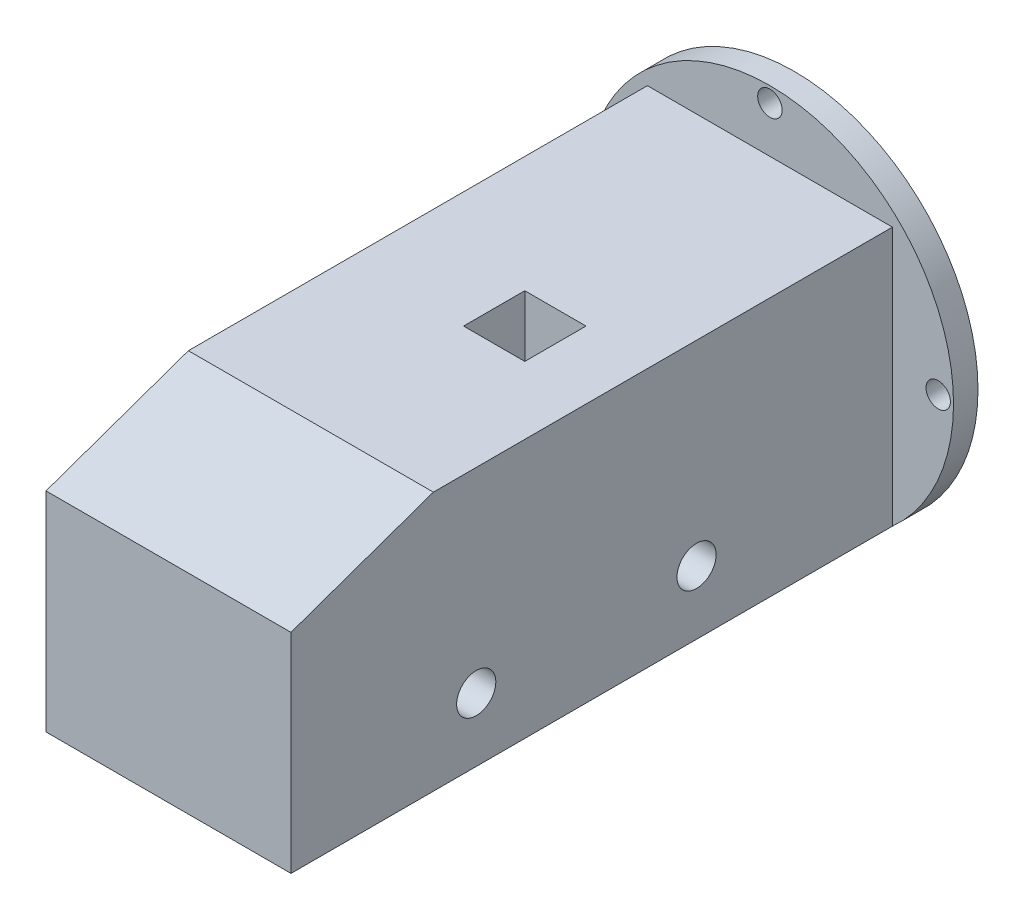
ISO-10303-21;
HEADER;
FILE_DESCRIPTION(('STEP AP214'),'2;1');
FILE_NAME('part.step','',(''),(''),'','','');
FILE_SCHEMA(('AUTOMOTIVE_DESIGN { 1 0 10303 214 1 1 1 1 }'));
ENDSEC;
DATA;
#1=APPLICATION_CONTEXT('core data for automotive mechanical design processes');
#2=APPLICATION_PROTOCOL_DEFINITION('international standard','automotive_design',2000,#1);
#3=PRODUCT_CONTEXT('',#1,'mechanical');
#4=PRODUCT('Part','Part','',(#3));
#5=PRODUCT_RELATED_PRODUCT_CATEGORY('part','',(#4));
#6=PRODUCT_DEFINITION_FORMATION('','',#4);
#7=PRODUCT_DEFINITION_CONTEXT('part definition',#1,'design');
#8=PRODUCT_DEFINITION('design','',#6,#7);
#9=PRODUCT_DEFINITION_SHAPE('','',#8);
#10=(LENGTH_UNIT() NAMED_UNIT(*) SI_UNIT(.MILLI.,.METRE.));
#11=(NAMED_UNIT(*) PLANE_ANGLE_UNIT() SI_UNIT($,.RADIAN.));
#12=(NAMED_UNIT(*) SI_UNIT($,.STERADIAN.) SOLID_ANGLE_UNIT());
#13=UNCERTAINTY_MEASURE_WITH_UNIT(LENGTH_MEASURE(1.E-05),#10,'distance_accuracy_value','');
#14=(GEOMETRIC_REPRESENTATION_CONTEXT(3) GLOBAL_UNCERTAINTY_ASSIGNED_CONTEXT((#13)) GLOBAL_UNIT_ASSIGNED_CONTEXT((#10,
#11,#12)) REPRESENTATION_CONTEXT('',''));
#15=CARTESIAN_POINT('',(0.,0.,0.));
#16=DIRECTION('',(0.,0.,1.));
#17=DIRECTION('',(1.,0.,0.));
#18=AXIS2_PLACEMENT_3D('',#15,#16,#17);
#19=CARTESIAN_POINT('',(8.98442745033423,-18.4610339679543,87.3736426774216));
#20=DIRECTION('',(0.,0.,1.));
#21=DIRECTION('',(1.,0.,0.));
#22=AXIS2_PLACEMENT_3D('',#19,#20,#21);
#23=PLANE('',#22);
#24=DIRECTION('',(0.,1.,0.));
#25=VECTOR('',#24,1.);
#26=CARTESIAN_POINT('',(-5.01557254966576,-18.4610339679543,87.3736426774216));
#27=LINE('',#26,#25);
#28=CARTESIAN_POINT('',(-5.01557254966576,-18.4610339679543,87.3736426774216));
#29=VERTEX_POINT('',#28);
#30=CARTESIAN_POINT('',(-5.01557254966576,-5.46103396795427,87.3736426774216));
#31=VERTEX_POINT('',#30);
#32=EDGE_CURVE('E238',#29,#31,#27,.T.);
#33=ORIENTED_EDGE('',*,*,#32,.F.);
#34=DIRECTION('',(-1.,0.,0.));
#35=VECTOR('',#34,1.);
#36=CARTESIAN_POINT('',(8.98442745033423,-18.4610339679543,87.3736426774216));
#37=LINE('',#36,#35);
#38=CARTESIAN_POINT('',(-8.01557254966577,-18.4610339679543,87.3736426774216));
#39=VERTEX_POINT('',#38);
#40=EDGE_CURVE('E336',#29,#39,#37,.T.);
#41=ORIENTED_EDGE('',*,*,#40,.T.);
#42=DIRECTION('',(0.,1.,0.));
#43=VECTOR('',#42,1.);
#44=CARTESIAN_POINT('',(-8.01557254966577,-18.4610339679543,87.3736426774216));
#45=LINE('',#44,#43);
#46=CARTESIAN_POINT('',(-8.01557254966577,-5.46103396795427,87.3736426774216));
#47=VERTEX_POINT('',#46);
#48=EDGE_CURVE('E325',#39,#47,#45,.T.);
#49=ORIENTED_EDGE('',*,*,#48,.T.);
#50=DIRECTION('',(-1.,0.,0.));
#51=VECTOR('',#50,1.);
#52=CARTESIAN_POINT('',(8.98442745033423,-5.46103396795427,87.3736426774216));
#53=LINE('',#52,#51);
#54=EDGE_CURVE('E334',#31,#47,#53,.T.);
#55=ORIENTED_EDGE('',*,*,#54,.F.);
#56=EDGE_LOOP('',(#33,#41,#49,#55));
#57=FACE_BOUND('',#56,.T.);
#58=ADVANCED_FACE('F48',(#57),#23,.F.);
#59=CARTESIAN_POINT('',(-3.01557254966577,-11.9610339679543,90.4236426774216));
#60=DIRECTION('',(-1.,0.,0.));
#61=DIRECTION('',(0.,0.,1.));
#62=AXIS2_PLACEMENT_3D('',#59,#60,#61);
#63=CYLINDRICAL_SURFACE('',#62,0.999999999999998);
#64=CARTESIAN_POINT('',(-8.01557254966577,-11.9610339679543,90.4236426774216));
#65=DIRECTION('',(-1.,0.,0.));
#66=DIRECTION('',(0.,0.,1.));
#67=AXIS2_PLACEMENT_3D('',#64,#65,#66);
#68=CIRCLE('',#67,0.999999999999998);
#69=CARTESIAN_POINT('',(-8.01557254966577,-11.9610339679543,91.4236426774216));
#70=VERTEX_POINT('',#69);
#71=EDGE_CURVE('E319',#70,#70,#68,.T.);
#72=ORIENTED_EDGE('',*,*,#71,.T.);
#73=EDGE_LOOP('',(#72));
#74=FACE_BOUND('',#73,.T.);
#75=CARTESIAN_POINT('',(-5.01557254966576,-11.9610339679543,90.4236426774216));
#76=DIRECTION('',(1.,0.,0.));
#77=DIRECTION('',(0.,1.,0.));
#78=AXIS2_PLACEMENT_3D('',#75,#76,#77);
#79=CIRCLE('',#78,0.999999999999998);
#80=CARTESIAN_POINT('',(-5.01557254966576,-10.9610339679543,90.4236426774216));
#81=VERTEX_POINT('',#80);
#82=EDGE_CURVE('E52',#81,#81,#79,.F.);
#83=ORIENTED_EDGE('',*,*,#82,.F.);
#84=EDGE_LOOP('',(#83));
#85=FACE_BOUND('',#84,.T.);
#86=ADVANCED_FACE('F454',(#74,#85),#63,.F.);
#87=CARTESIAN_POINT('',(0.,0.,60.0325967803664));
#88=DIRECTION('',(0.,0.,-1.));
#89=DIRECTION('',(-1.,0.,0.));
#90=AXIS2_PLACEMENT_3D('',#87,#88,#89);
#91=PLANE('',#90);
#92=DIRECTION('',(-1.,0.,0.));
#93=VECTOR('',#92,1.);
#94=CARTESIAN_POINT('',(8.98442745033423,-6.96103396795427,60.0325967803664));
#95=LINE('',#94,#93);
#96=CARTESIAN_POINT('',(8.98442745033423,-6.96103396795427,60.0325967803664));
#97=VERTEX_POINT('',#96);
#98=CARTESIAN_POINT('',(-1.01557254966576,-6.96103396795427,60.0325967803664));
#99=VERTEX_POINT('',#98);
#100=EDGE_CURVE('E257',#97,#99,#95,.T.);
#101=ORIENTED_EDGE('',*,*,#100,.F.);
#102=DIRECTION('',(0.,1.,0.));
#103=VECTOR('',#102,1.);
#104=CARTESIAN_POINT('',(8.98442745033423,-5.46103396795427,60.0325967803664));
#105=LINE('',#104,#103);
#106=CARTESIAN_POINT('',(8.98442745033423,-5.46103396795427,60.0325967803664));
#107=VERTEX_POINT('',#106);
#108=EDGE_CURVE('E284',#97,#107,#105,.T.);
#109=ORIENTED_EDGE('',*,*,#108,.T.);
#110=DIRECTION('',(-1.,0.,0.));
#111=VECTOR('',#110,1.);
#112=CARTESIAN_POINT('',(8.98442745033423,-5.46103396795427,60.0325967803664));
#113=LINE('',#112,#111);
#114=CARTESIAN_POINT('',(-5.01557254966576,-5.46103396795427,60.0325967803664));
#115=VERTEX_POINT('',#114);
#116=EDGE_CURVE('E210',#107,#115,#113,.T.);
#117=ORIENTED_EDGE('',*,*,#116,.T.);
#118=DIRECTION('',(0.,-1.,0.));
#119=VECTOR('',#118,1.);
#120=CARTESIAN_POINT('',(-5.01557254966576,-5.46103396795427,60.0325967803664));
#121=LINE('',#120,#119);
#122=CARTESIAN_POINT('',(-5.01557254966576,-18.4610339679543,60.0325967803664));
#123=VERTEX_POINT('',#122);
#124=EDGE_CURVE('E286',#115,#123,#121,.T.);
#125=ORIENTED_EDGE('',*,*,#124,.T.);
#126=DIRECTION('',(1.,0.,0.));
#127=VECTOR('',#126,1.);
#128=CARTESIAN_POINT('',(8.98442745033423,-18.4610339679543,60.0325967803664));
#129=LINE('',#128,#127);
#130=CARTESIAN_POINT('',(8.98442745033423,-18.4610339679543,60.0325967803664));
#131=VERTEX_POINT('',#130);
#132=EDGE_CURVE('E289',#123,#131,#129,.T.);
#133=ORIENTED_EDGE('',*,*,#132,.T.);
#134=CARTESIAN_POINT('',(8.98442745033423,-16.9394701423471,60.0325967803664));
#135=VERTEX_POINT('',#134);
#136=EDGE_CURVE('E281',#131,#135,#105,.T.);
#137=ORIENTED_EDGE('',*,*,#136,.T.);
#138=DIRECTION('',(1.,0.,0.));
#139=VECTOR('',#138,1.);
#140=CARTESIAN_POINT('',(8.98442745033423,-16.9394701423471,60.0325967803664));
#141=LINE('',#140,#139);
#142=CARTESIAN_POINT('',(-1.01557254966576,-16.9394701423471,60.0325967803664));
#143=VERTEX_POINT('',#142);
#144=EDGE_CURVE('E261',#143,#135,#141,.T.);
#145=ORIENTED_EDGE('',*,*,#144,.F.);
#146=DIRECTION('',(0.,-1.,0.));
#147=VECTOR('',#146,1.);
#148=CARTESIAN_POINT('',(-1.01557254966576,-6.96103396795427,60.0325967803664));
#149=LINE('',#148,#147);
#150=EDGE_CURVE('E73',#99,#143,#149,.T.);
#151=ORIENTED_EDGE('',*,*,#150,.F.);
#152=EDGE_LOOP('',(#101,#109,#117,#125,#133,#137,#145,#151));
#153=FACE_BOUND('',#152,.T.);
#154=ADVANCED_FACE('F460',(#153),#91,.F.);
#155=CARTESIAN_POINT('',(20.0155725496658,-22.3467414964479,154.));
#156=DIRECTION('',(0.,1.,0.));
#157=DIRECTION('',(0.,0.,1.));
#158=AXIS2_PLACEMENT_3D('',#155,#156,#157);
#159=PLANE('',#158);
#160=DIRECTION('',(-1.,0.,0.));
#161=VECTOR('',#160,1.);
#162=CARTESIAN_POINT('',(30.,-22.3467414964479,102.262078687684));
#163=LINE('',#162,#161);
#164=CARTESIAN_POINT('',(20.0155725496658,-22.3467414964479,102.262078687684));
#165=VERTEX_POINT('',#164);
#166=CARTESIAN_POINT('',(-20.0155725496658,-22.3467414964479,102.262078687684));
#167=VERTEX_POINT('',#166);
#168=EDGE_CURVE('E306',#165,#167,#163,.T.);
#169=ORIENTED_EDGE('',*,*,#168,.T.);
#170=DIRECTION('',(0.,0.,-1.));
#171=VECTOR('',#170,1.);
#172=CARTESIAN_POINT('',(-20.0155725496658,-22.3467414964479,154.));
#173=LINE('',#172,#171);
#174=CARTESIAN_POINT('',(-20.0155725496658,-22.3467414964479,4.));
#175=VERTEX_POINT('',#174);
#176=EDGE_CURVE('E390',#167,#175,#173,.T.);
#177=ORIENTED_EDGE('',*,*,#176,.T.);
#178=DIRECTION('',(1.,0.,0.));
#179=VECTOR('',#178,1.);
#180=CARTESIAN_POINT('',(20.0155725496658,-22.3467414964479,4.));
#181=LINE('',#180,#179);
#182=CARTESIAN_POINT('',(20.0155725496658,-22.3467414964479,4.));
#183=VERTEX_POINT('',#182);
#184=EDGE_CURVE('E378',#175,#183,#181,.T.);
#185=ORIENTED_EDGE('',*,*,#184,.T.);
#186=DIRECTION('',(0.,0.,-1.));
#187=VECTOR('',#186,1.);
#188=CARTESIAN_POINT('',(20.0155725496658,-22.3467414964479,154.));
#189=LINE('',#188,#187);
#190=EDGE_CURVE('E396',#165,#183,#189,.T.);
#191=ORIENTED_EDGE('',*,*,#190,.F.);
#192=EDGE_LOOP('',(#169,#177,#185,#191));
#193=FACE_BOUND('',#192,.T.);
#194=ADVANCED_FACE('F506',(#193),#159,.F.);
#195=CARTESIAN_POINT('',(20.0155725496658,19.9742180609268,154.));
#196=DIRECTION('',(-1.,0.,0.));
#197=DIRECTION('',(0.,0.,1.));
#198=AXIS2_PLACEMENT_3D('',#195,#196,#197);
#199=PLANE('',#198);
#200=CARTESIAN_POINT('',(20.0155725496658,-11.9610339679543,72.));
#201=DIRECTION('',(1.,0.,0.));
#202=DIRECTION('',(0.,0.,-1.));
#203=AXIS2_PLACEMENT_3D('',#200,#201,#202);
#204=CIRCLE('',#203,3.2);
#205=CARTESIAN_POINT('',(20.0155725496658,-11.9610339679543,68.8));
#206=VERTEX_POINT('',#205);
#207=EDGE_CURVE('E303',#206,#206,#204,.T.);
#208=ORIENTED_EDGE('',*,*,#207,.F.);
#209=EDGE_LOOP('',(#208));
#210=FACE_BOUND('',#209,.T.);
#211=CARTESIAN_POINT('',(20.0155725496658,-11.9610339679543,36.));
#212=DIRECTION('',(-1.,0.,0.));
#213=DIRECTION('',(0.,0.,1.));
#214=AXIS2_PLACEMENT_3D('',#211,#212,#213);
#215=CIRCLE('',#214,3.2);
#216=CARTESIAN_POINT('',(20.0155725496658,-11.9610339679543,39.2));
#217=VERTEX_POINT('',#216);
#218=EDGE_CURVE('E375',#217,#217,#215,.F.);
#219=ORIENTED_EDGE('',*,*,#218,.F.);
#220=EDGE_LOOP('',(#219));
#221=FACE_BOUND('',#220,.T.);
#222=DIRECTION('',(0.,1.,0.));
#223=VECTOR('',#222,1.);
#224=CARTESIAN_POINT('',(20.0155725496658,19.9742180609268,102.262078687684));
#225=LINE('',#224,#223);
#226=CARTESIAN_POINT('',(20.0155725496658,11.7672606789775,102.262078687684));
#227=VERTEX_POINT('',#226);
#228=EDGE_CURVE('E316',#165,#227,#225,.T.);
#229=ORIENTED_EDGE('',*,*,#228,.F.);
#230=ORIENTED_EDGE('',*,*,#190,.T.);
#231=DIRECTION('',(0.,1.,0.));
#232=VECTOR('',#231,1.);
#233=CARTESIAN_POINT('',(20.0155725496658,19.9742180609268,4.));
#234=LINE('',#233,#232);
#235=CARTESIAN_POINT('',(20.0155725496658,19.9742180609268,4.));
#236=VERTEX_POINT('',#235);
#237=EDGE_CURVE('E381',#183,#236,#234,.T.);
#238=ORIENTED_EDGE('',*,*,#237,.T.);
#239=DIRECTION('',(0.,0.,-1.));
#240=VECTOR('',#239,1.);
#241=CARTESIAN_POINT('',(20.0155725496658,19.9742180609268,154.));
#242=LINE('',#241,#240);
#243=CARTESIAN_POINT('',(20.0155725496658,19.9742180609268,79.));
#244=VERTEX_POINT('',#243);
#245=EDGE_CURVE('E394',#244,#236,#242,.T.);
#246=ORIENTED_EDGE('',*,*,#245,.F.);
#247=DIRECTION('',(0.,-0.332705190064486,0.943030888414666));
#248=VECTOR('',#247,1.);
#249=CARTESIAN_POINT('',(20.0155725496658,-3.55712726157436,145.698044237812));
#250=LINE('',#249,#248);
#251=EDGE_CURVE('E309',#244,#227,#250,.T.);
#252=ORIENTED_EDGE('',*,*,#251,.T.);
#253=EDGE_LOOP('',(#229,#230,#238,#246,#252));
#254=FACE_BOUND('',#253,.T.);
#255=ADVANCED_FACE('F498',(#210,#221,#254),#199,.F.);
#256=CARTESIAN_POINT('',(-20.0155725496658,19.9742180609268,154.));
#257=DIRECTION('',(1.,0.,0.));
#258=DIRECTION('',(0.,0.,-1.));
#259=AXIS2_PLACEMENT_3D('',#256,#257,#258);
#260=PLANE('',#259);
#261=CARTESIAN_POINT('',(-20.0155725496658,-11.9610339679543,36.));
#262=DIRECTION('',(-1.,0.,0.));
#263=DIRECTION('',(0.,0.,1.));
#264=AXIS2_PLACEMENT_3D('',#261,#262,#263);
#265=CIRCLE('',#264,3.2);
#266=CARTESIAN_POINT('',(-20.0155725496658,-11.9610339679543,39.2));
#267=VERTEX_POINT('',#266);
#268=EDGE_CURVE('E366',#267,#267,#265,.T.);
#269=ORIENTED_EDGE('',*,*,#268,.F.);
#270=EDGE_LOOP('',(#269));
#271=FACE_BOUND('',#270,.T.);
#272=DIRECTION('',(0.,-1.,0.));
#273=VECTOR('',#272,1.);
#274=CARTESIAN_POINT('',(-20.0155725496658,-5.46103396795427,60.0736426774216));
#275=LINE('',#274,#273);
#276=CARTESIAN_POINT('',(-20.0155725496658,-5.46103396795427,60.0736426774215));
#277=VERTEX_POINT('',#276);
#278=CARTESIAN_POINT('',(-20.0155725496658,-18.4610339679543,60.0736426774216));
#279=VERTEX_POINT('',#278);
#280=EDGE_CURVE('E355',#277,#279,#275,.T.);
#281=ORIENTED_EDGE('',*,*,#280,.F.);
#282=DIRECTION('',(0.,0.,-1.));
#283=VECTOR('',#282,1.);
#284=CARTESIAN_POINT('',(-20.0155725496658,-5.46103396795427,60.0736426774216));
#285=LINE('',#284,#283);
#286=CARTESIAN_POINT('',(-20.0155725496658,-5.46103396795427,93.4736426774216));
#287=VERTEX_POINT('',#286);
#288=EDGE_CURVE('E333',#287,#277,#285,.T.);
#289=ORIENTED_EDGE('',*,*,#288,.F.);
#290=DIRECTION('',(0.,1.,0.));
#291=VECTOR('',#290,1.);
#292=CARTESIAN_POINT('',(-20.0155725496658,-18.4610339679543,93.4736426774216));
#293=LINE('',#292,#291);
#294=CARTESIAN_POINT('',(-20.0155725496658,-18.4610339679543,93.4736426774216));
#295=VERTEX_POINT('',#294);
#296=EDGE_CURVE('E361',#295,#287,#293,.T.);
#297=ORIENTED_EDGE('',*,*,#296,.F.);
#298=DIRECTION('',(0.,0.,1.));
#299=VECTOR('',#298,1.);
#300=CARTESIAN_POINT('',(-20.0155725496658,-18.4610339679543,60.0736426774216));
#301=LINE('',#300,#299);
#302=EDGE_CURVE('E358',#279,#295,#301,.T.);
#303=ORIENTED_EDGE('',*,*,#302,.F.);
#304=EDGE_LOOP('',(#281,#289,#297,#303));
#305=FACE_BOUND('',#304,.T.);
#306=DIRECTION('',(0.,-1.,0.));
#307=VECTOR('',#306,1.);
#308=CARTESIAN_POINT('',(-20.0155725496658,19.9742180609268,102.262078687684));
#309=LINE('',#308,#307);
#310=CARTESIAN_POINT('',(-20.0155725496658,11.7672606789775,102.262078687684));
#311=VERTEX_POINT('',#310);
#312=EDGE_CURVE('E13',#311,#167,#309,.T.);
#313=ORIENTED_EDGE('',*,*,#312,.F.);
#314=DIRECTION('',(0.,0.332705190064486,-0.943030888414666));
#315=VECTOR('',#314,1.);
#316=CARTESIAN_POINT('',(-20.0155725496658,-3.55712726157436,145.698044237812));
#317=LINE('',#316,#315);
#318=CARTESIAN_POINT('',(-20.0155725496658,19.9742180609268,78.9999999999999));
#319=VERTEX_POINT('',#318);
#320=EDGE_CURVE('E57',#311,#319,#317,.T.);
#321=ORIENTED_EDGE('',*,*,#320,.T.);
#322=DIRECTION('',(0.,0.,-1.));
#323=VECTOR('',#322,1.);
#324=CARTESIAN_POINT('',(-20.0155725496658,19.9742180609268,154.));
#325=LINE('',#324,#323);
#326=CARTESIAN_POINT('',(-20.0155725496658,19.9742180609268,4.));
#327=VERTEX_POINT('',#326);
#328=EDGE_CURVE('E392',#319,#327,#325,.T.);
#329=ORIENTED_EDGE('',*,*,#328,.T.);
#330=DIRECTION('',(0.,-1.,0.));
#331=VECTOR('',#330,1.);
#332=CARTESIAN_POINT('',(-20.0155725496658,19.9742180609268,4.));
#333=LINE('',#332,#331);
#334=EDGE_CURVE('E387',#327,#175,#333,.T.);
#335=ORIENTED_EDGE('',*,*,#334,.T.);
#336=ORIENTED_EDGE('',*,*,#176,.F.);
#337=EDGE_LOOP('',(#313,#321,#329,#335,#336));
#338=FACE_BOUND('',#337,.T.);
#339=ADVANCED_FACE('F495',(#271,#305,#338),#260,.F.);
#340=CARTESIAN_POINT('',(-8.01557254966577,0.,0.));
#341=DIRECTION('',(-1.,0.,0.));
#342=DIRECTION('',(0.,0.,1.));
#343=AXIS2_PLACEMENT_3D('',#340,#341,#342);
#344=PLANE('',#343);
#345=CARTESIAN_POINT('',(-8.01557254966577,-11.9610339679543,63.103119728894));
#346=DIRECTION('',(-1.,0.,0.));
#347=DIRECTION('',(0.,0.,1.));
#348=AXIS2_PLACEMENT_3D('',#345,#346,#347);
#349=CIRCLE('',#348,0.999999999999998);
#350=CARTESIAN_POINT('',(-8.01557254966577,-11.9610339679543,64.103119728894));
#351=VERTEX_POINT('',#350);
#352=EDGE_CURVE('E318',#351,#351,#349,.T.);
#353=ORIENTED_EDGE('',*,*,#352,.F.);
#354=EDGE_LOOP('',(#353));
#355=FACE_BOUND('',#354,.T.);
#356=DIRECTION('',(0.,-1.,0.));
#357=VECTOR('',#356,1.);
#358=CARTESIAN_POINT('',(-8.01557254966577,-18.4610339679543,66.1325967803664));
#359=LINE('',#358,#357);
#360=CARTESIAN_POINT('',(-8.01557254966577,-5.46103396795427,66.1325967803664));
#361=VERTEX_POINT('',#360);
#362=CARTESIAN_POINT('',(-8.01557254966577,-18.4610339679543,66.1325967803664));
#363=VERTEX_POINT('',#362);
#364=EDGE_CURVE('E322',#361,#363,#359,.T.);
#365=ORIENTED_EDGE('',*,*,#364,.F.);
#366=DIRECTION('',(0.,0.,-1.));
#367=VECTOR('',#366,1.);
#368=CARTESIAN_POINT('',(-8.01557254966577,-5.46103396795427,60.0736426774216));
#369=LINE('',#368,#367);
#370=CARTESIAN_POINT('',(-8.01557254966577,-5.46103396795427,60.0736426774216));
#371=VERTEX_POINT('',#370);
#372=EDGE_CURVE('E343',#361,#371,#369,.T.);
#373=ORIENTED_EDGE('',*,*,#372,.T.);
#374=DIRECTION('',(0.,-1.,0.));
#375=VECTOR('',#374,1.);
#376=CARTESIAN_POINT('',(-8.01557254966577,-5.46103396795427,60.0736426774216));
#377=LINE('',#376,#375);
#378=CARTESIAN_POINT('',(-8.01557254966577,-18.4610339679543,60.0736426774216));
#379=VERTEX_POINT('',#378);
#380=EDGE_CURVE('E342',#371,#379,#377,.T.);
#381=ORIENTED_EDGE('',*,*,#380,.T.);
#382=DIRECTION('',(0.,0.,1.));
#383=VECTOR('',#382,1.);
#384=CARTESIAN_POINT('',(-8.01557254966577,-18.4610339679543,60.0736426774216));
#385=LINE('',#384,#383);
#386=EDGE_CURVE('E347',#379,#363,#385,.T.);
#387=ORIENTED_EDGE('',*,*,#386,.T.);
#388=EDGE_LOOP('',(#365,#373,#381,#387));
#389=FACE_BOUND('',#388,.T.);
#390=ADVANCED_FACE('F476',(#355,#389),#344,.T.);
#391=CARTESIAN_POINT('',(0.,0.,4.));
#392=DIRECTION('',(0.,0.,1.));
#393=DIRECTION('',(1.,0.,0.));
#394=AXIS2_PLACEMENT_3D('',#391,#392,#393);
#395=PLANE('',#394);
#396=ORIENTED_EDGE('',*,*,#184,.F.);
#397=CARTESIAN_POINT('',(0.,0.,4.));
#398=DIRECTION('',(0.,0.,1.));
#399=DIRECTION('',(1.,0.,0.));
#400=AXIS2_PLACEMENT_3D('',#397,#398,#399);
#401=CIRCLE('',#400,30.);
#402=EDGE_CURVE('E423',#175,#183,#401,.T.);
#403=ORIENTED_EDGE('',*,*,#402,.T.);
#404=EDGE_LOOP('',(#396,#403));
#405=FACE_BOUND('',#404,.T.);
#406=CARTESIAN_POINT('',(0.,-27.5,4.));
#407=DIRECTION('',(0.,0.,1.));
#408=DIRECTION('',(1.,0.,0.));
#409=AXIS2_PLACEMENT_3D('',#406,#407,#408);
#410=CIRCLE('',#409,1.99901261968799);
#411=CARTESIAN_POINT('',(1.9990126196879,-27.5,4.));
#412=VERTEX_POINT('',#411);
#413=EDGE_CURVE('E411',#412,#412,#410,.T.);
#414=ORIENTED_EDGE('',*,*,#413,.F.);
#415=EDGE_LOOP('',(#414));
#416=FACE_BOUND('',#415,.T.);
#417=ADVANCED_FACE('F529',(#405,#416),#395,.T.);
#418=ORIENTED_EDGE('',*,*,#334,.F.);
#419=DIRECTION('',(-1.,0.,0.));
#420=VECTOR('',#419,1.);
#421=CARTESIAN_POINT('',(-20.0155725496658,19.9742180609268,4.));
#422=LINE('',#421,#420);
#423=EDGE_CURVE('E384',#236,#327,#422,.T.);
#424=ORIENTED_EDGE('',*,*,#423,.F.);
#425=ORIENTED_EDGE('',*,*,#237,.F.);
#426=EDGE_CURVE('E426',#183,#175,#401,.T.);
#427=ORIENTED_EDGE('',*,*,#426,.T.);
#428=EDGE_LOOP('',(#418,#424,#425,#427));
#429=FACE_BOUND('',#428,.T.);
#430=CARTESIAN_POINT('',(-27.5,1.92031473636372E-13,4.));
#431=DIRECTION('',(0.,0.,1.));
#432=DIRECTION('',(1.,0.,0.));
#433=AXIS2_PLACEMENT_3D('',#430,#431,#432);
#434=CIRCLE('',#433,1.99901261968799);
#435=CARTESIAN_POINT('',(-25.500987380312,1.92031473636372E-13,4.));
#436=VERTEX_POINT('',#435);
#437=EDGE_CURVE('E405',#436,#436,#434,.T.);
#438=ORIENTED_EDGE('',*,*,#437,.F.);
#439=EDGE_LOOP('',(#438));
#440=FACE_BOUND('',#439,.T.);
#441=CARTESIAN_POINT('',(27.5,0.,4.));
#442=DIRECTION('',(0.,0.,1.));
#443=DIRECTION('',(1.,0.,0.));
#444=AXIS2_PLACEMENT_3D('',#441,#442,#443);
#445=CIRCLE('',#444,1.99901261968799);
#446=CARTESIAN_POINT('',(29.499012619688,0.,4.));
#447=VERTEX_POINT('',#446);
#448=EDGE_CURVE('E417',#447,#447,#445,.T.);
#449=ORIENTED_EDGE('',*,*,#448,.F.);
#450=EDGE_LOOP('',(#449));
#451=FACE_BOUND('',#450,.T.);
#452=CARTESIAN_POINT('',(2.88047210454558E-13,27.5,4.));
#453=DIRECTION('',(0.,0.,1.));
#454=DIRECTION('',(1.,0.,0.));
#455=AXIS2_PLACEMENT_3D('',#452,#453,#454);
#456=CIRCLE('',#455,1.99901261968799);
#457=CARTESIAN_POINT('',(1.99901261968828,27.5,4.));
#458=VERTEX_POINT('',#457);
#459=EDGE_CURVE('E399',#458,#458,#456,.T.);
#460=ORIENTED_EDGE('',*,*,#459,.F.);
#461=EDGE_LOOP('',(#460));
#462=FACE_BOUND('',#461,.T.);
#463=ADVANCED_FACE('F526',(#429,#440,#451,#462),#395,.T.);
#464=CARTESIAN_POINT('',(0.,0.,0.));
#465=DIRECTION('',(0.,0.,1.));
#466=DIRECTION('',(1.,0.,0.));
#467=AXIS2_PLACEMENT_3D('',#464,#465,#466);
#468=PLANE('',#467);
#469=CARTESIAN_POINT('',(0.,0.,0.));
#470=DIRECTION('',(0.,0.,1.));
#471=DIRECTION('',(1.,0.,0.));
#472=AXIS2_PLACEMENT_3D('',#469,#470,#471);
#473=CIRCLE('',#472,30.);
#474=CARTESIAN_POINT('',(30.,0.,0.));
#475=VERTEX_POINT('',#474);
#476=EDGE_CURVE('E420',#475,#475,#473,.T.);
#477=ORIENTED_EDGE('',*,*,#476,.F.);
#478=EDGE_LOOP('',(#477));
#479=FACE_BOUND('',#478,.T.);
#480=CARTESIAN_POINT('',(27.5,0.,0.));
#481=DIRECTION('',(0.,0.,1.));
#482=DIRECTION('',(1.,0.,0.));
#483=AXIS2_PLACEMENT_3D('',#480,#481,#482);
#484=CIRCLE('',#483,1.99901261968799);
#485=CARTESIAN_POINT('',(29.499012619688,0.,0.));
#486=VERTEX_POINT('',#485);
#487=EDGE_CURVE('E414',#486,#486,#484,.T.);
#488=ORIENTED_EDGE('',*,*,#487,.T.);
#489=EDGE_LOOP('',(#488));
#490=FACE_BOUND('',#489,.T.);
#491=CARTESIAN_POINT('',(0.,-27.5,0.));
#492=DIRECTION('',(0.,0.,1.));
#493=DIRECTION('',(1.,0.,0.));
#494=AXIS2_PLACEMENT_3D('',#491,#492,#493);
#495=CIRCLE('',#494,1.99901261968799);
#496=CARTESIAN_POINT('',(1.9990126196879,-27.5,0.));
#497=VERTEX_POINT('',#496);
#498=EDGE_CURVE('E408',#497,#497,#495,.T.);
#499=ORIENTED_EDGE('',*,*,#498,.T.);
#500=EDGE_LOOP('',(#499));
#501=FACE_BOUND('',#500,.T.);
#502=CARTESIAN_POINT('',(-27.5,1.92031473636372E-13,0.));
#503=DIRECTION('',(0.,0.,1.));
#504=DIRECTION('',(1.,0.,0.));
#505=AXIS2_PLACEMENT_3D('',#502,#503,#504);
#506=CIRCLE('',#505,1.99901261968799);
#507=CARTESIAN_POINT('',(-25.500987380312,1.92031473636372E-13,0.));
#508=VERTEX_POINT('',#507);
#509=EDGE_CURVE('E402',#508,#508,#506,.T.);
#510=ORIENTED_EDGE('',*,*,#509,.T.);
#511=EDGE_LOOP('',(#510));
#512=FACE_BOUND('',#511,.T.);
#513=CARTESIAN_POINT('',(2.88047210454558E-13,27.5,0.));
#514=DIRECTION('',(0.,0.,1.));
#515=DIRECTION('',(1.,0.,0.));
#516=AXIS2_PLACEMENT_3D('',#513,#514,#515);
#517=CIRCLE('',#516,1.99901261968799);
#518=CARTESIAN_POINT('',(1.99901261968828,27.5,0.));
#519=VERTEX_POINT('',#518);
#520=EDGE_CURVE('E398',#519,#519,#517,.T.);
#521=ORIENTED_EDGE('',*,*,#520,.T.);
#522=EDGE_LOOP('',(#521));
#523=FACE_BOUND('',#522,.T.);
#524=ADVANCED_FACE('F528',(#479,#490,#501,#512,#523),#468,.F.);
#525=CARTESIAN_POINT('',(0.,0.,4.));
#526=DIRECTION('',(0.,0.,-1.));
#527=DIRECTION('',(-1.,0.,0.));
#528=AXIS2_PLACEMENT_3D('',#525,#526,#527);
#529=CYLINDRICAL_SURFACE('',#528,30.);
#530=ORIENTED_EDGE('',*,*,#402,.F.);
#531=ORIENTED_EDGE('',*,*,#426,.F.);
#532=EDGE_LOOP('',(#530,#531));
#533=FACE_BOUND('',#532,.T.);
#534=ORIENTED_EDGE('',*,*,#476,.T.);
#535=EDGE_LOOP('',(#534));
#536=FACE_BOUND('',#535,.T.);
#537=ADVANCED_FACE('F50',(#533,#536),#529,.T.);
#538=CARTESIAN_POINT('',(27.5,0.,4.));
#539=DIRECTION('',(0.,0.,-1.));
#540=DIRECTION('',(-1.,0.,0.));
#541=AXIS2_PLACEMENT_3D('',#538,#539,#540);
#542=CYLINDRICAL_SURFACE('',#541,1.99901261968799);
#543=ORIENTED_EDGE('',*,*,#448,.T.);
#544=EDGE_LOOP('',(#543));
#545=FACE_BOUND('',#544,.T.);
#546=ORIENTED_EDGE('',*,*,#487,.F.);
#547=EDGE_LOOP('',(#546));
#548=FACE_BOUND('',#547,.T.);
#549=ADVANCED_FACE('F521',(#545,#548),#542,.F.);
#550=CARTESIAN_POINT('',(0.,-27.5,4.));
#551=DIRECTION('',(0.,0.,-1.));
#552=DIRECTION('',(-1.,0.,0.));
#553=AXIS2_PLACEMENT_3D('',#550,#551,#552);
#554=CYLINDRICAL_SURFACE('',#553,1.99901261968799);
#555=ORIENTED_EDGE('',*,*,#413,.T.);
#556=EDGE_LOOP('',(#555));
#557=FACE_BOUND('',#556,.T.);
#558=ORIENTED_EDGE('',*,*,#498,.F.);
#559=EDGE_LOOP('',(#558));
#560=FACE_BOUND('',#559,.T.);
#561=ADVANCED_FACE('F517',(#557,#560),#554,.F.);
#562=CARTESIAN_POINT('',(-27.5,1.92031473636372E-13,4.));
#563=DIRECTION('',(0.,0.,-1.));
#564=DIRECTION('',(-1.,0.,0.));
#565=AXIS2_PLACEMENT_3D('',#562,#563,#564);
#566=CYLINDRICAL_SURFACE('',#565,1.99901261968799);
#567=ORIENTED_EDGE('',*,*,#437,.T.);
#568=EDGE_LOOP('',(#567));
#569=FACE_BOUND('',#568,.T.);
#570=ORIENTED_EDGE('',*,*,#509,.F.);
#571=EDGE_LOOP('',(#570));
#572=FACE_BOUND('',#571,.T.);
#573=ADVANCED_FACE('F513',(#569,#572),#566,.F.);
#574=CARTESIAN_POINT('',(2.88047210454558E-13,27.5,4.));
#575=DIRECTION('',(0.,0.,-1.));
#576=DIRECTION('',(-1.,0.,0.));
#577=AXIS2_PLACEMENT_3D('',#574,#575,#576);
#578=CYLINDRICAL_SURFACE('',#577,1.99901261968799);
#579=ORIENTED_EDGE('',*,*,#459,.T.);
#580=EDGE_LOOP('',(#579));
#581=FACE_BOUND('',#580,.T.);
#582=ORIENTED_EDGE('',*,*,#520,.F.);
#583=EDGE_LOOP('',(#582));
#584=FACE_BOUND('',#583,.T.);
#585=ADVANCED_FACE('F502',(#581,#584),#578,.F.);
#586=CARTESIAN_POINT('',(-20.0155725496658,19.9742180609268,154.));
#587=DIRECTION('',(0.,-1.,0.));
#588=DIRECTION('',(0.,0.,-1.));
#589=AXIS2_PLACEMENT_3D('',#586,#587,#588);
#590=PLANE('',#589);
#591=DIRECTION('',(1.,0.,0.));
#592=VECTOR('',#591,1.);
#593=CARTESIAN_POINT('',(-20.0155725496658,19.9742180609268,43.0325967803664));
#594=LINE('',#593,#592);
#595=CARTESIAN_POINT('',(-1.01557254966577,19.9742180609268,43.0325967803664));
#596=VERTEX_POINT('',#595);
#597=CARTESIAN_POINT('',(8.98442745033423,19.9742180609268,43.0325967803664));
#598=VERTEX_POINT('',#597);
#599=EDGE_CURVE('E251',#596,#598,#594,.T.);
#600=ORIENTED_EDGE('',*,*,#599,.T.);
#601=DIRECTION('',(0.,0.,1.));
#602=VECTOR('',#601,1.);
#603=CARTESIAN_POINT('',(8.98442745033423,19.9742180609268,154.));
#604=LINE('',#603,#602);
#605=CARTESIAN_POINT('',(8.98442745033423,19.9742180609268,53.0325967803664));
#606=VERTEX_POINT('',#605);
#607=EDGE_CURVE('E254',#598,#606,#604,.T.);
#608=ORIENTED_EDGE('',*,*,#607,.T.);
#609=DIRECTION('',(-1.,0.,0.));
#610=VECTOR('',#609,1.);
#611=CARTESIAN_POINT('',(-20.0155725496658,19.9742180609268,53.0325967803664));
#612=LINE('',#611,#610);
#613=CARTESIAN_POINT('',(-1.01557254966576,19.9742180609268,53.0325967803664));
#614=VERTEX_POINT('',#613);
#615=EDGE_CURVE('E244',#606,#614,#612,.T.);
#616=ORIENTED_EDGE('',*,*,#615,.T.);
#617=DIRECTION('',(0.,0.,-1.));
#618=VECTOR('',#617,1.);
#619=CARTESIAN_POINT('',(-1.01557254966576,19.9742180609268,154.));
#620=LINE('',#619,#618);
#621=EDGE_CURVE('E248',#614,#596,#620,.T.);
#622=ORIENTED_EDGE('',*,*,#621,.T.);
#623=EDGE_LOOP('',(#600,#608,#616,#622));
#624=FACE_BOUND('',#623,.T.);
#625=ORIENTED_EDGE('',*,*,#328,.F.);
#626=DIRECTION('',(-1.,0.,0.));
#627=VECTOR('',#626,1.);
#628=CARTESIAN_POINT('',(30.,19.9742180609268,79.));
#629=LINE('',#628,#627);
#630=EDGE_CURVE('E302',#244,#319,#629,.T.);
#631=ORIENTED_EDGE('',*,*,#630,.F.);
#632=ORIENTED_EDGE('',*,*,#245,.T.);
#633=ORIENTED_EDGE('',*,*,#423,.T.);
#634=EDGE_LOOP('',(#625,#631,#632,#633));
#635=FACE_BOUND('',#634,.T.);
#636=ADVANCED_FACE('F493',(#624,#635),#590,.F.);
#637=CARTESIAN_POINT('',(30.001,-11.9610339679543,36.));
#638=DIRECTION('',(-1.,0.,0.));
#639=DIRECTION('',(0.,0.,1.));
#640=AXIS2_PLACEMENT_3D('',#637,#638,#639);
#641=CYLINDRICAL_SURFACE('',#640,3.2);
#642=ORIENTED_EDGE('',*,*,#268,.T.);
#643=EDGE_LOOP('',(#642));
#644=FACE_BOUND('',#643,.T.);
#645=ORIENTED_EDGE('',*,*,#218,.T.);
#646=EDGE_LOOP('',(#645));
#647=FACE_BOUND('',#646,.T.);
#648=ADVANCED_FACE('F490',(#644,#647),#641,.F.);
#649=CARTESIAN_POINT('',(-8.01557254966577,-5.46103396795427,60.0736426774216));
#650=DIRECTION('',(0.,1.,0.));
#651=DIRECTION('',(0.,0.,1.));
#652=AXIS2_PLACEMENT_3D('',#649,#650,#651);
#653=PLANE('',#652);
#654=ORIENTED_EDGE('',*,*,#116,.F.);
#655=DIRECTION('',(0.,0.,-1.));
#656=VECTOR('',#655,1.);
#657=CARTESIAN_POINT('',(8.98442745033423,-5.46103396795427,87.3736426774216));
#658=LINE('',#657,#656);
#659=CARTESIAN_POINT('',(8.98442745033423,-5.46103396795427,93.4325967803664));
#660=VERTEX_POINT('',#659);
#661=EDGE_CURVE('E203',#660,#107,#658,.T.);
#662=ORIENTED_EDGE('',*,*,#661,.F.);
#663=DIRECTION('',(-1.,0.,0.));
#664=VECTOR('',#663,1.);
#665=CARTESIAN_POINT('',(8.98442745033423,-5.46103396795427,93.4325967803664));
#666=LINE('',#665,#664);
#667=CARTESIAN_POINT('',(-5.01557254966576,-5.46103396795427,93.4325967803664));
#668=VERTEX_POINT('',#667);
#669=EDGE_CURVE('E207',#660,#668,#666,.T.);
#670=ORIENTED_EDGE('',*,*,#669,.T.);
#671=DIRECTION('',(0.,0.,-1.));
#672=VECTOR('',#671,1.);
#673=CARTESIAN_POINT('',(-5.01557254966576,-5.46103396795427,93.4325967803664));
#674=LINE('',#673,#672);
#675=EDGE_CURVE('E236',#668,#31,#674,.T.);
#676=ORIENTED_EDGE('',*,*,#675,.T.);
#677=ORIENTED_EDGE('',*,*,#54,.T.);
#678=CARTESIAN_POINT('',(-8.01557254966577,-5.46103396795427,93.4736426774216));
#679=VERTEX_POINT('',#678);
#680=EDGE_CURVE('E339',#679,#47,#369,.T.);
#681=ORIENTED_EDGE('',*,*,#680,.F.);
#682=DIRECTION('',(-1.,0.,0.));
#683=VECTOR('',#682,1.);
#684=CARTESIAN_POINT('',(-8.01557254966577,-5.46103396795427,93.4736426774216));
#685=LINE('',#684,#683);
#686=EDGE_CURVE('E364',#679,#287,#685,.T.);
#687=ORIENTED_EDGE('',*,*,#686,.T.);
#688=ORIENTED_EDGE('',*,*,#288,.T.);
#689=DIRECTION('',(-1.,0.,0.));
#690=VECTOR('',#689,1.);
#691=CARTESIAN_POINT('',(-8.01557254966577,-5.46103396795427,60.0736426774216));
#692=LINE('',#691,#690);
#693=EDGE_CURVE('E353',#371,#277,#692,.T.);
#694=ORIENTED_EDGE('',*,*,#693,.F.);
#695=ORIENTED_EDGE('',*,*,#372,.F.);
#696=DIRECTION('',(-1.,0.,0.));
#697=VECTOR('',#696,1.);
#698=CARTESIAN_POINT('',(8.98442745033423,-5.46103396795427,66.1325967803664));
#699=LINE('',#698,#697);
#700=CARTESIAN_POINT('',(-5.01557254966576,-5.46103396795427,66.1325967803664));
#701=VERTEX_POINT('',#700);
#702=EDGE_CURVE('E331',#701,#361,#699,.T.);
#703=ORIENTED_EDGE('',*,*,#702,.F.);
#704=DIRECTION('',(0.,0.,1.));
#705=VECTOR('',#704,1.);
#706=CARTESIAN_POINT('',(-5.01557254966576,-5.46103396795427,60.0325967803664));
#707=LINE('',#706,#705);
#708=EDGE_CURVE('E292',#115,#701,#707,.T.);
#709=ORIENTED_EDGE('',*,*,#708,.F.);
#710=EDGE_LOOP('',(#654,#662,#670,#676,#677,#681,#687,#688,#694,#695,#703,#709));
#711=FACE_BOUND('',#710,.T.);
#712=ADVANCED_FACE('F205',(#711),#653,.F.);
#713=CARTESIAN_POINT('',(-8.01557254966577,-18.4610339679543,93.4736426774216));
#714=DIRECTION('',(0.,0.,1.));
#715=DIRECTION('',(1.,0.,0.));
#716=AXIS2_PLACEMENT_3D('',#713,#714,#715);
#717=PLANE('',#716);
#718=ORIENTED_EDGE('',*,*,#296,.T.);
#719=ORIENTED_EDGE('',*,*,#686,.F.);
#720=DIRECTION('',(0.,1.,0.));
#721=VECTOR('',#720,1.);
#722=CARTESIAN_POINT('',(-8.01557254966577,-18.4610339679543,93.4736426774216));
#723=LINE('',#722,#721);
#724=CARTESIAN_POINT('',(-8.01557254966577,-18.4610339679543,93.4736426774216));
#725=VERTEX_POINT('',#724);
#726=EDGE_CURVE('E350',#725,#679,#723,.T.);
#727=ORIENTED_EDGE('',*,*,#726,.F.);
#728=DIRECTION('',(-1.,0.,0.));
#729=VECTOR('',#728,1.);
#730=CARTESIAN_POINT('',(-8.01557254966577,-18.4610339679543,93.4736426774216));
#731=LINE('',#730,#729);
#732=EDGE_CURVE('E367',#725,#295,#731,.T.);
#733=ORIENTED_EDGE('',*,*,#732,.T.);
#734=EDGE_LOOP('',(#718,#719,#727,#733));
#735=FACE_BOUND('',#734,.T.);
#736=ADVANCED_FACE('F477',(#735),#717,.F.);
#737=CARTESIAN_POINT('',(-8.01557254966577,-18.4610339679543,60.0736426774216));
#738=DIRECTION('',(0.,-1.,0.));
#739=DIRECTION('',(0.,0.,-1.));
#740=AXIS2_PLACEMENT_3D('',#737,#738,#739);
#741=PLANE('',#740);
#742=DIRECTION('',(0.,0.,1.));
#743=VECTOR('',#742,1.);
#744=CARTESIAN_POINT('',(-5.01557254966576,-18.4610339679543,60.0325967803664));
#745=LINE('',#744,#743);
#746=CARTESIAN_POINT('',(-5.01557254966576,-18.4610339679543,66.1325967803664));
#747=VERTEX_POINT('',#746);
#748=EDGE_CURVE('E295',#123,#747,#745,.T.);
#749=ORIENTED_EDGE('',*,*,#748,.T.);
#750=DIRECTION('',(-1.,0.,0.));
#751=VECTOR('',#750,1.);
#752=CARTESIAN_POINT('',(8.98442745033423,-18.4610339679543,66.1325967803664));
#753=LINE('',#752,#751);
#754=EDGE_CURVE('E215',#747,#363,#753,.T.);
#755=ORIENTED_EDGE('',*,*,#754,.T.);
#756=ORIENTED_EDGE('',*,*,#386,.F.);
#757=DIRECTION('',(-1.,0.,0.));
#758=VECTOR('',#757,1.);
#759=CARTESIAN_POINT('',(-8.01557254966577,-18.4610339679543,60.0736426774216));
#760=LINE('',#759,#758);
#761=EDGE_CURVE('E369',#379,#279,#760,.T.);
#762=ORIENTED_EDGE('',*,*,#761,.T.);
#763=ORIENTED_EDGE('',*,*,#302,.T.);
#764=ORIENTED_EDGE('',*,*,#732,.F.);
#765=EDGE_CURVE('E346',#39,#725,#385,.T.);
#766=ORIENTED_EDGE('',*,*,#765,.F.);
#767=ORIENTED_EDGE('',*,*,#40,.F.);
#768=DIRECTION('',(0.,0.,-1.));
#769=VECTOR('',#768,1.);
#770=CARTESIAN_POINT('',(-5.01557254966576,-18.4610339679543,93.4325967803664));
#771=LINE('',#770,#769);
#772=CARTESIAN_POINT('',(-5.01557254966576,-18.4610339679543,93.4325967803664));
#773=VERTEX_POINT('',#772);
#774=EDGE_CURVE('E234',#773,#29,#771,.T.);
#775=ORIENTED_EDGE('',*,*,#774,.F.);
#776=DIRECTION('',(1.,0.,0.));
#777=VECTOR('',#776,1.);
#778=CARTESIAN_POINT('',(8.98442745033423,-18.4610339679543,93.4325967803664));
#779=LINE('',#778,#777);
#780=CARTESIAN_POINT('',(8.98442745033423,-18.4610339679543,93.4325967803664));
#781=VERTEX_POINT('',#780);
#782=EDGE_CURVE('E232',#773,#781,#779,.T.);
#783=ORIENTED_EDGE('',*,*,#782,.T.);
#784=DIRECTION('',(0.,0.,1.));
#785=VECTOR('',#784,1.);
#786=CARTESIAN_POINT('',(8.98442745033423,-18.4610339679543,87.3736426774216));
#787=LINE('',#786,#785);
#788=EDGE_CURVE('E216',#131,#781,#787,.T.);
#789=ORIENTED_EDGE('',*,*,#788,.F.);
#790=ORIENTED_EDGE('',*,*,#132,.F.);
#791=EDGE_LOOP('',(#749,#755,#756,#762,#763,#764,#766,#767,#775,#783,#789,#790));
#792=FACE_BOUND('',#791,.T.);
#793=ADVANCED_FACE('F480',(#792),#741,.F.);
#794=CARTESIAN_POINT('',(-8.01557254966577,-5.46103396795427,60.0736426774216));
#795=DIRECTION('',(0.,0.,-1.));
#796=DIRECTION('',(-1.,0.,0.));
#797=AXIS2_PLACEMENT_3D('',#794,#795,#796);
#798=PLANE('',#797);
#799=ORIENTED_EDGE('',*,*,#280,.T.);
#800=ORIENTED_EDGE('',*,*,#761,.F.);
#801=ORIENTED_EDGE('',*,*,#380,.F.);
#802=ORIENTED_EDGE('',*,*,#693,.T.);
#803=EDGE_LOOP('',(#799,#800,#801,#802));
#804=FACE_BOUND('',#803,.T.);
#805=ADVANCED_FACE('F474',(#804),#798,.F.);
#806=ORIENTED_EDGE('',*,*,#71,.F.);
#807=EDGE_LOOP('',(#806));
#808=FACE_BOUND('',#807,.T.);
#809=ORIENTED_EDGE('',*,*,#48,.F.);
#810=ORIENTED_EDGE('',*,*,#765,.T.);
#811=ORIENTED_EDGE('',*,*,#726,.T.);
#812=ORIENTED_EDGE('',*,*,#680,.T.);
#813=EDGE_LOOP('',(#809,#810,#811,#812));
#814=FACE_BOUND('',#813,.T.);
#815=ADVANCED_FACE('F470',(#808,#814),#344,.T.);
#816=CARTESIAN_POINT('',(8.98442745033423,-18.4610339679543,66.1325967803664));
#817=DIRECTION('',(0.,0.,-1.));
#818=DIRECTION('',(-1.,0.,0.));
#819=AXIS2_PLACEMENT_3D('',#816,#817,#818);
#820=PLANE('',#819);
#821=ORIENTED_EDGE('',*,*,#754,.F.);
#822=DIRECTION('',(0.,-1.,0.));
#823=VECTOR('',#822,1.);
#824=CARTESIAN_POINT('',(-5.01557254966576,-5.46103396795427,66.1325967803664));
#825=LINE('',#824,#823);
#826=EDGE_CURVE('E275',#701,#747,#825,.T.);
#827=ORIENTED_EDGE('',*,*,#826,.F.);
#828=ORIENTED_EDGE('',*,*,#702,.T.);
#829=ORIENTED_EDGE('',*,*,#364,.T.);
#830=EDGE_LOOP('',(#821,#827,#828,#829));
#831=FACE_BOUND('',#830,.T.);
#832=ADVANCED_FACE('F467',(#831),#820,.F.);
#833=CARTESIAN_POINT('',(8.98442745033423,0.,0.));
#834=DIRECTION('',(-1.,0.,0.));
#835=DIRECTION('',(0.,0.,1.));
#836=AXIS2_PLACEMENT_3D('',#833,#834,#835);
#837=PLANE('',#836);
#838=ORIENTED_EDGE('',*,*,#788,.T.);
#839=DIRECTION('',(0.,1.,0.));
#840=VECTOR('',#839,1.);
#841=CARTESIAN_POINT('',(8.98442745033423,-5.46103396795427,93.4325967803664));
#842=LINE('',#841,#840);
#843=EDGE_CURVE('E223',#781,#660,#842,.T.);
#844=ORIENTED_EDGE('',*,*,#843,.T.);
#845=ORIENTED_EDGE('',*,*,#661,.T.);
#846=ORIENTED_EDGE('',*,*,#108,.F.);
#847=DIRECTION('',(0.,0.,1.));
#848=VECTOR('',#847,1.);
#849=CARTESIAN_POINT('',(8.98442745033423,-6.96103396795427,43.0325967803664));
#850=LINE('',#849,#848);
#851=CARTESIAN_POINT('',(8.98442745033423,-6.96103396795427,53.0325967803664));
#852=VERTEX_POINT('',#851);
#853=EDGE_CURVE('E267',#852,#97,#850,.T.);
#854=ORIENTED_EDGE('',*,*,#853,.F.);
#855=DIRECTION('',(0.,-1.,0.));
#856=VECTOR('',#855,1.);
#857=CARTESIAN_POINT('',(8.98442745033423,38.0389660320457,53.0325967803664));
#858=LINE('',#857,#856);
#859=EDGE_CURVE('E242',#606,#852,#858,.T.);
#860=ORIENTED_EDGE('',*,*,#859,.F.);
#861=ORIENTED_EDGE('',*,*,#607,.F.);
#862=DIRECTION('',(0.,1.,0.));
#863=VECTOR('',#862,1.);
#864=CARTESIAN_POINT('',(8.98442745033423,-6.96103396795427,43.0325967803664));
#865=LINE('',#864,#863);
#866=CARTESIAN_POINT('',(8.98442745033423,-16.9394701423471,43.0325967803664));
#867=VERTEX_POINT('',#866);
#868=EDGE_CURVE('E258',#867,#598,#865,.T.);
#869=ORIENTED_EDGE('',*,*,#868,.F.);
#870=DIRECTION('',(0.,0.,1.));
#871=VECTOR('',#870,1.);
#872=CARTESIAN_POINT('',(8.98442745033423,-16.9394701423471,43.0325967803664));
#873=LINE('',#872,#871);
#874=EDGE_CURVE('E273',#867,#135,#873,.T.);
#875=ORIENTED_EDGE('',*,*,#874,.T.);
#876=ORIENTED_EDGE('',*,*,#136,.F.);
#877=EDGE_LOOP('',(#838,#844,#845,#846,#854,#860,#861,#869,#875,#876));
#878=FACE_BOUND('',#877,.T.);
#879=ADVANCED_FACE('F226',(#878),#837,.T.);
#880=CARTESIAN_POINT('',(-3.01557254966577,-11.9610339679543,63.103119728894));
#881=DIRECTION('',(-1.,0.,0.));
#882=DIRECTION('',(0.,0.,1.));
#883=AXIS2_PLACEMENT_3D('',#880,#881,#882);
#884=CYLINDRICAL_SURFACE('',#883,0.999999999999998);
#885=CARTESIAN_POINT('',(-5.01557254966576,-11.9610339679543,63.103119728894));
#886=DIRECTION('',(-1.,0.,0.));
#887=DIRECTION('',(0.,-1.,0.));
#888=AXIS2_PLACEMENT_3D('',#885,#886,#887);
#889=CIRCLE('',#888,0.999999999999998);
#890=CARTESIAN_POINT('',(-5.01557254966576,-12.9610339679543,63.103119728894));
#891=VERTEX_POINT('',#890);
#892=EDGE_CURVE('E297',#891,#891,#889,.F.);
#893=ORIENTED_EDGE('',*,*,#892,.T.);
#894=EDGE_LOOP('',(#893));
#895=FACE_BOUND('',#894,.T.);
#896=ORIENTED_EDGE('',*,*,#352,.T.);
#897=EDGE_LOOP('',(#896));
#898=FACE_BOUND('',#897,.T.);
#899=ADVANCED_FACE('F433',(#895,#898),#884,.F.);
#900=CARTESIAN_POINT('',(30.,0.,102.262078687684));
#901=DIRECTION('',(0.,0.,1.));
#902=DIRECTION('',(1.,0.,0.));
#903=AXIS2_PLACEMENT_3D('',#900,#901,#902);
#904=PLANE('',#903);
#905=ORIENTED_EDGE('',*,*,#228,.T.);
#906=DIRECTION('',(-1.,0.,0.));
#907=VECTOR('',#906,1.);
#908=CARTESIAN_POINT('',(30.,11.7672606789775,102.262078687684));
#909=LINE('',#908,#907);
#910=EDGE_CURVE('E310',#227,#311,#909,.T.);
#911=ORIENTED_EDGE('',*,*,#910,.T.);
#912=ORIENTED_EDGE('',*,*,#312,.T.);
#913=ORIENTED_EDGE('',*,*,#168,.F.);
#914=EDGE_LOOP('',(#905,#911,#912,#913));
#915=FACE_BOUND('',#914,.T.);
#916=ADVANCED_FACE('F668',(#915),#904,.T.);
#917=CARTESIAN_POINT('',(30.,42.5495674709464,15.0116630393532));
#918=DIRECTION('',(0.,-0.943030888414666,-0.332705190064486));
#919=DIRECTION('',(0.,0.332705190064486,-0.943030888414666));
#920=AXIS2_PLACEMENT_3D('',#917,#918,#919);
#921=PLANE('',#920);
#922=ORIENTED_EDGE('',*,*,#630,.T.);
#923=ORIENTED_EDGE('',*,*,#320,.F.);
#924=ORIENTED_EDGE('',*,*,#910,.F.);
#925=ORIENTED_EDGE('',*,*,#251,.F.);
#926=EDGE_LOOP('',(#922,#923,#924,#925));
#927=FACE_BOUND('',#926,.T.);
#928=ADVANCED_FACE('F672',(#927),#921,.F.);
#929=CARTESIAN_POINT('',(10.0155725496658,-11.9610339679543,72.));
#930=DIRECTION('',(1.,0.,0.));
#931=DIRECTION('',(0.,0.,-1.));
#932=AXIS2_PLACEMENT_3D('',#929,#930,#931);
#933=CYLINDRICAL_SURFACE('',#932,3.2);
#934=CARTESIAN_POINT('',(10.0155725496658,-11.9610339679543,72.));
#935=DIRECTION('',(1.,0.,0.));
#936=DIRECTION('',(0.,0.,-1.));
#937=AXIS2_PLACEMENT_3D('',#934,#935,#936);
#938=CIRCLE('',#937,3.2);
#939=CARTESIAN_POINT('',(10.0155725496658,-11.9610339679543,68.8));
#940=VERTEX_POINT('',#939);
#941=EDGE_CURVE('E299',#940,#940,#938,.T.);
#942=ORIENTED_EDGE('',*,*,#941,.F.);
#943=EDGE_LOOP('',(#942));
#944=FACE_BOUND('',#943,.T.);
#945=ORIENTED_EDGE('',*,*,#207,.T.);
#946=EDGE_LOOP('',(#945));
#947=FACE_BOUND('',#946,.T.);
#948=ADVANCED_FACE('F449',(#944,#947),#933,.F.);
#949=CARTESIAN_POINT('',(10.0155725496658,-11.9610339679543,72.));
#950=DIRECTION('',(1.,0.,0.));
#951=DIRECTION('',(0.,0.,-1.));
#952=AXIS2_PLACEMENT_3D('',#949,#950,#951);
#953=PLANE('',#952);
#954=ORIENTED_EDGE('',*,*,#941,.T.);
#955=EDGE_LOOP('',(#954));
#956=FACE_BOUND('',#955,.T.);
#957=ADVANCED_FACE('F439',(#956),#953,.T.);
#958=CARTESIAN_POINT('',(-5.01557254966576,-5.46103396795427,60.0325967803664));
#959=DIRECTION('',(-1.,0.,0.));
#960=DIRECTION('',(0.,-1.,0.));
#961=AXIS2_PLACEMENT_3D('',#958,#959,#960);
#962=PLANE('',#961);
#963=ORIENTED_EDGE('',*,*,#826,.T.);
#964=ORIENTED_EDGE('',*,*,#748,.F.);
#965=ORIENTED_EDGE('',*,*,#124,.F.);
#966=ORIENTED_EDGE('',*,*,#708,.T.);
#967=EDGE_LOOP('',(#963,#964,#965,#966));
#968=FACE_BOUND('',#967,.T.);
#969=ORIENTED_EDGE('',*,*,#892,.F.);
#970=EDGE_LOOP('',(#969));
#971=FACE_BOUND('',#970,.T.);
#972=ADVANCED_FACE('F436',(#968,#971),#962,.F.);
#973=CARTESIAN_POINT('',(8.98442745033423,-16.9394701423471,43.0325967803664));
#974=DIRECTION('',(0.,-1.,0.));
#975=DIRECTION('',(0.,0.,-1.));
#976=AXIS2_PLACEMENT_3D('',#973,#974,#975);
#977=PLANE('',#976);
#978=ORIENTED_EDGE('',*,*,#144,.T.);
#979=ORIENTED_EDGE('',*,*,#874,.F.);
#980=DIRECTION('',(1.,0.,0.));
#981=VECTOR('',#980,1.);
#982=CARTESIAN_POINT('',(8.98442745033423,-16.9394701423471,43.0325967803664));
#983=LINE('',#982,#981);
#984=CARTESIAN_POINT('',(-1.01557254966576,-16.9394701423471,43.0325967803664));
#985=VERTEX_POINT('',#984);
#986=EDGE_CURVE('E264',#985,#867,#983,.T.);
#987=ORIENTED_EDGE('',*,*,#986,.F.);
#988=DIRECTION('',(0.,0.,1.));
#989=VECTOR('',#988,1.);
#990=CARTESIAN_POINT('',(-1.01557254966576,-16.9394701423471,43.0325967803664));
#991=LINE('',#990,#989);
#992=EDGE_CURVE('E276',#985,#143,#991,.T.);
#993=ORIENTED_EDGE('',*,*,#992,.T.);
#994=EDGE_LOOP('',(#978,#979,#987,#993));
#995=FACE_BOUND('',#994,.T.);
#996=ADVANCED_FACE('F438',(#995),#977,.F.);
#997=CARTESIAN_POINT('',(-1.01557254966576,-6.96103396795427,43.0325967803664));
#998=DIRECTION('',(-1.,0.,0.));
#999=DIRECTION('',(0.,-1.,0.));
#1000=AXIS2_PLACEMENT_3D('',#997,#998,#999);
#1001=PLANE('',#1000);
#1002=ORIENTED_EDGE('',*,*,#150,.T.);
#1003=ORIENTED_EDGE('',*,*,#992,.F.);
#1004=DIRECTION('',(0.,-1.,0.));
#1005=VECTOR('',#1004,1.);
#1006=CARTESIAN_POINT('',(-1.01557254966576,-6.96103396795427,43.0325967803664));
#1007=LINE('',#1006,#1005);
#1008=EDGE_CURVE('E260',#596,#985,#1007,.T.);
#1009=ORIENTED_EDGE('',*,*,#1008,.F.);
#1010=ORIENTED_EDGE('',*,*,#621,.F.);
#1011=DIRECTION('',(0.,-1.,0.));
#1012=VECTOR('',#1011,1.);
#1013=CARTESIAN_POINT('',(-1.01557254966577,38.0389660320457,53.0325967803664));
#1014=LINE('',#1013,#1012);
#1015=CARTESIAN_POINT('',(-1.01557254966577,-6.96103396795427,53.0325967803664));
#1016=VERTEX_POINT('',#1015);
#1017=EDGE_CURVE('E65',#614,#1016,#1014,.T.);
#1018=ORIENTED_EDGE('',*,*,#1017,.T.);
#1019=DIRECTION('',(0.,0.,1.));
#1020=VECTOR('',#1019,1.);
#1021=CARTESIAN_POINT('',(-1.01557254966576,-6.96103396795427,43.0325967803664));
#1022=LINE('',#1021,#1020);
#1023=EDGE_CURVE('E278',#1016,#99,#1022,.T.);
#1024=ORIENTED_EDGE('',*,*,#1023,.T.);
#1025=EDGE_LOOP('',(#1002,#1003,#1009,#1010,#1018,#1024));
#1026=FACE_BOUND('',#1025,.T.);
#1027=ADVANCED_FACE('F446',(#1026),#1001,.F.);
#1028=CARTESIAN_POINT('',(8.98442745033423,-6.96103396795427,43.0325967803664));
#1029=DIRECTION('',(0.,1.,0.));
#1030=DIRECTION('',(0.,0.,1.));
#1031=AXIS2_PLACEMENT_3D('',#1028,#1029,#1030);
#1032=PLANE('',#1031);
#1033=ORIENTED_EDGE('',*,*,#1023,.F.);
#1034=DIRECTION('',(-1.,0.,0.));
#1035=VECTOR('',#1034,1.);
#1036=CARTESIAN_POINT('',(8.98442745033423,-6.96103396795427,53.0325967803664));
#1037=LINE('',#1036,#1035);
#1038=EDGE_CURVE('E240',#852,#1016,#1037,.T.);
#1039=ORIENTED_EDGE('',*,*,#1038,.F.);
#1040=ORIENTED_EDGE('',*,*,#853,.T.);
#1041=ORIENTED_EDGE('',*,*,#100,.T.);
#1042=EDGE_LOOP('',(#1033,#1039,#1040,#1041));
#1043=FACE_BOUND('',#1042,.T.);
#1044=ADVANCED_FACE('F604',(#1043),#1032,.F.);
#1045=CARTESIAN_POINT('',(0.,0.,43.0325967803664));
#1046=DIRECTION('',(0.,0.,-1.));
#1047=DIRECTION('',(-1.,0.,0.));
#1048=AXIS2_PLACEMENT_3D('',#1045,#1046,#1047);
#1049=PLANE('',#1048);
#1050=ORIENTED_EDGE('',*,*,#868,.T.);
#1051=ORIENTED_EDGE('',*,*,#599,.F.);
#1052=ORIENTED_EDGE('',*,*,#1008,.T.);
#1053=ORIENTED_EDGE('',*,*,#986,.T.);
#1054=EDGE_LOOP('',(#1050,#1051,#1052,#1053));
#1055=FACE_BOUND('',#1054,.T.);
#1056=ADVANCED_FACE('F610',(#1055),#1049,.F.);
#1057=CARTESIAN_POINT('',(8.98442745033423,38.0389660320457,53.0325967803664));
#1058=DIRECTION('',(0.,0.,1.));
#1059=DIRECTION('',(1.,0.,0.));
#1060=AXIS2_PLACEMENT_3D('',#1057,#1058,#1059);
#1061=PLANE('',#1060);
#1062=ORIENTED_EDGE('',*,*,#859,.T.);
#1063=ORIENTED_EDGE('',*,*,#1038,.T.);
#1064=ORIENTED_EDGE('',*,*,#1017,.F.);
#1065=ORIENTED_EDGE('',*,*,#615,.F.);
#1066=EDGE_LOOP('',(#1062,#1063,#1064,#1065));
#1067=FACE_BOUND('',#1066,.T.);
#1068=ADVANCED_FACE('F605',(#1067),#1061,.F.);
#1069=CARTESIAN_POINT('',(-5.01557254966576,-5.46103396795427,93.4325967803664));
#1070=DIRECTION('',(1.,0.,0.));
#1071=DIRECTION('',(0.,1.,0.));
#1072=AXIS2_PLACEMENT_3D('',#1069,#1070,#1071);
#1073=PLANE('',#1072);
#1074=ORIENTED_EDGE('',*,*,#82,.T.);
#1075=EDGE_LOOP('',(#1074));
#1076=FACE_BOUND('',#1075,.T.);
#1077=ORIENTED_EDGE('',*,*,#32,.T.);
#1078=ORIENTED_EDGE('',*,*,#675,.F.);
#1079=DIRECTION('',(0.,-1.,0.));
#1080=VECTOR('',#1079,1.);
#1081=CARTESIAN_POINT('',(-5.01557254966576,-5.46103396795427,93.4325967803664));
#1082=LINE('',#1081,#1080);
#1083=EDGE_CURVE('E224',#668,#773,#1082,.T.);
#1084=ORIENTED_EDGE('',*,*,#1083,.T.);
#1085=ORIENTED_EDGE('',*,*,#774,.T.);
#1086=EDGE_LOOP('',(#1077,#1078,#1084,#1085));
#1087=FACE_BOUND('',#1086,.T.);
#1088=ADVANCED_FACE('F616',(#1076,#1087),#1073,.T.);
#1089=CARTESIAN_POINT('',(0.,0.,93.4325967803664));
#1090=DIRECTION('',(0.,0.,-1.));
#1091=DIRECTION('',(-1.,0.,0.));
#1092=AXIS2_PLACEMENT_3D('',#1089,#1090,#1091);
#1093=PLANE('',#1092);
#1094=ORIENTED_EDGE('',*,*,#843,.F.);
#1095=ORIENTED_EDGE('',*,*,#782,.F.);
#1096=ORIENTED_EDGE('',*,*,#1083,.F.);
#1097=ORIENTED_EDGE('',*,*,#669,.F.);
#1098=EDGE_LOOP('',(#1094,#1095,#1096,#1097));
#1099=FACE_BOUND('',#1098,.T.);
#1100=ADVANCED_FACE('F221',(#1099),#1093,.T.);
#1101=CLOSED_SHELL('',(#58,#86,#154,#194,#255,#339,#390,#417,#463,#524,#537,#549,#561,#573,#585,
#636,#648,#712,#736,#793,#805,#815,#832,#879,#899,#916,#928,#948,#957,#972,#996,#1027,#1044,
#1056,#1068,#1088,#1100));
#1102=MANIFOLD_SOLID_BREP('B2',#1101);
#1103=ADVANCED_BREP_SHAPE_REPRESENTATION('',(#18,#1102),#14);
#1104=SHAPE_DEFINITION_REPRESENTATION(#9,#1103);
ENDSEC;
END-ISO-10303-21;
